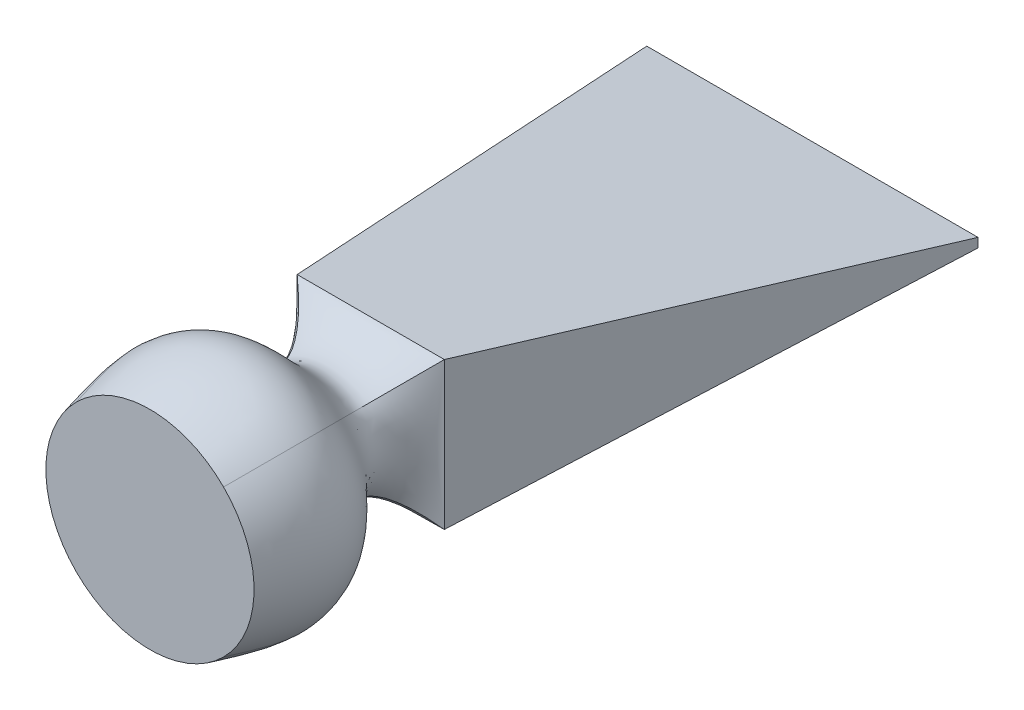
ISO-10303-21;
HEADER;
FILE_DESCRIPTION(('STEP AP214'),'2;1');
FILE_NAME('part.step','',(''),(''),'','','');
FILE_SCHEMA(('AUTOMOTIVE_DESIGN { 1 0 10303 214 1 1 1 1 }'));
ENDSEC;
DATA;
#1=APPLICATION_CONTEXT('core data for automotive mechanical design processes');
#2=APPLICATION_PROTOCOL_DEFINITION('international standard','automotive_design',2000,#1);
#3=PRODUCT_CONTEXT('',#1,'mechanical');
#4=PRODUCT('Part','Part','',(#3));
#5=PRODUCT_RELATED_PRODUCT_CATEGORY('part','',(#4));
#6=PRODUCT_DEFINITION_FORMATION('','',#4);
#7=PRODUCT_DEFINITION_CONTEXT('part definition',#1,'design');
#8=PRODUCT_DEFINITION('design','',#6,#7);
#9=PRODUCT_DEFINITION_SHAPE('','',#8);
#10=(LENGTH_UNIT() NAMED_UNIT(*) SI_UNIT(.MILLI.,.METRE.));
#11=(NAMED_UNIT(*) PLANE_ANGLE_UNIT() SI_UNIT($,.RADIAN.));
#12=(NAMED_UNIT(*) SI_UNIT($,.STERADIAN.) SOLID_ANGLE_UNIT());
#13=UNCERTAINTY_MEASURE_WITH_UNIT(LENGTH_MEASURE(1.E-05),#10,'distance_accuracy_value','');
#14=(GEOMETRIC_REPRESENTATION_CONTEXT(3) GLOBAL_UNCERTAINTY_ASSIGNED_CONTEXT((#13)) GLOBAL_UNIT_ASSIGNED_CONTEXT((#10,
#11,#12)) REPRESENTATION_CONTEXT('',''));
#15=CARTESIAN_POINT('',(0.,0.,0.));
#16=DIRECTION('',(0.,0.,1.));
#17=DIRECTION('',(1.,0.,0.));
#18=AXIS2_PLACEMENT_3D('',#15,#16,#17);
#19=CARTESIAN_POINT('',(0.,0.,120.));
#20=DIRECTION('',(0.,0.,1.));
#21=DIRECTION('',(1.,0.,0.));
#22=AXIS2_PLACEMENT_3D('',#19,#20,#21);
#23=PLANE('',#22);
#24=CARTESIAN_POINT('',(0.,0.,120.));
#25=DIRECTION('',(0.,0.,1.));
#26=DIRECTION('',(1.,0.,0.));
#27=AXIS2_PLACEMENT_3D('',#24,#25,#26);
#28=CIRCLE('',#27,56.5685424949238);
#29=CARTESIAN_POINT('',(40.,40.,120.));
#30=VERTEX_POINT('',#29);
#31=CARTESIAN_POINT('',(-40.,40.,120.));
#32=VERTEX_POINT('',#31);
#33=EDGE_CURVE('E12',#30,#32,#28,.T.);
#34=ORIENTED_EDGE('',*,*,#33,.T.);
#35=CARTESIAN_POINT('',(-40.,-40.,120.));
#36=VERTEX_POINT('',#35);
#37=EDGE_CURVE('E184',#32,#36,#28,.T.);
#38=ORIENTED_EDGE('',*,*,#37,.T.);
#39=CARTESIAN_POINT('',(40.,-40.,120.));
#40=VERTEX_POINT('',#39);
#41=EDGE_CURVE('E404',#36,#40,#28,.T.);
#42=ORIENTED_EDGE('',*,*,#41,.T.);
#43=EDGE_CURVE('E333',#40,#30,#28,.T.);
#44=ORIENTED_EDGE('',*,*,#43,.T.);
#45=EDGE_LOOP('',(#34,#38,#42,#44));
#46=FACE_BOUND('',#45,.T.);
#47=ADVANCED_FACE('F175',(#46),#23,.T.);
#48=CARTESIAN_POINT('',(-40.,40.,0.));
#49=CARTESIAN_POINT('',(-27.4754689570643,27.4754689570643,10.));
#50=CARTESIAN_POINT('',(-11.8947204291446,11.8947204291446,32.6873486435367));
#51=CARTESIAN_POINT('',(-51.8658504210996,51.8658504210997,61.8637702170009));
#52=CARTESIAN_POINT('',(-43.840184649959,43.840184649959,98.3967829380328));
#53=CARTESIAN_POINT('',(-40.,40.,120.));
#54=CARTESIAN_POINT('',(-40.,36.6666666666667,0.));
#55=CARTESIAN_POINT('',(-27.993020210486,25.2606382784789,10.3038903595026));
#56=CARTESIAN_POINT('',(-13.4608908876898,11.2033074205769,32.5304406272122));
#57=CARTESIAN_POINT('',(-54.9534209988408,48.3828038629849,61.9359519475802));
#58=CARTESIAN_POINT('',(-46.7230743139164,40.9315732365088,98.3969362491896));
#59=CARTESIAN_POINT('',(-42.65208984,37.34791016,120.));
#60=CARTESIAN_POINT('',(-40.,31.6666666666667,0.));
#61=CARTESIAN_POINT('',(-28.7693470906186,21.9383922606009,10.7597258987565));
#62=CARTESIAN_POINT('',(-15.4488633409755,9.96771951254661,32.2950786027253));
#63=CARTESIAN_POINT('',(-59.1128838345626,42.7350558968258,62.0442245434492));
#64=CARTESIAN_POINT('',(-50.6103809143646,36.2163083798921,98.3971662159247));
#65=CARTESIAN_POINT('',(-46.1931967045121,33.0174276635586,120.));
#66=CARTESIAN_POINT('',(-40.,25.,0.));
#67=CARTESIAN_POINT('',(-29.5883944416905,17.3981420751468,11.0996644725977));
#68=CARTESIAN_POINT('',(-17.5007065344625,8.08678073493347,32.1195583855776));
#69=CARTESIAN_POINT('',(-63.6051423677497,34.5095940951979,62.1249657224863));
#70=CARTESIAN_POINT('',(-54.7628097412085,29.2733814265444,98.3973471915394));
#71=CARTESIAN_POINT('',(-49.985072925353,26.6767896937507,120.));
#72=CARTESIAN_POINT('',(-40.,20.,0.));
#73=CARTESIAN_POINT('',(-30.1030006538141,13.9595304676869,11.2920050303675));
#74=CARTESIAN_POINT('',(-18.743012168115,6.57356776329644,32.0202256304617));
#75=CARTESIAN_POINT('',(-66.4153138190794,28.0475777859827,62.1707539022538));
#76=CARTESIAN_POINT('',(-57.3534143768364,23.8056143549874,98.3971123768349));
#77=CARTESIAN_POINT('',(-52.3450788527399,21.6839732900765,120.));
#78=CARTESIAN_POINT('',(-40.,15.,0.));
#79=CARTESIAN_POINT('',(-30.5044302449204,10.4916442838765,11.42231276476));
#80=CARTESIAN_POINT('',(-19.6994969603929,4.98727899470467,31.9529245168856));
#81=CARTESIAN_POINT('',(-68.6451069319628,21.3140907934409,62.2017972941066));
#82=CARTESIAN_POINT('',(-59.4014572635483,18.0965284475509,98.3968799973826));
#83=CARTESIAN_POINT('',(-54.2087291524593,16.4770290866052,120.));
#84=CARTESIAN_POINT('',(-40.,8.33333333333334,0.));
#85=CARTESIAN_POINT('',(-30.8869309853487,5.83773309784142,11.5354542151604));
#86=CARTESIAN_POINT('',(-20.6018883159679,2.7971533710389,31.8944567984615));
#87=CARTESIAN_POINT('',(-70.809264152299,12.0759780483755,62.2289074711133));
#88=CARTESIAN_POINT('',(-61.3834946525645,10.2535673476198,98.3961714981171));
#89=CARTESIAN_POINT('',(-56.0097391628533,9.32798009427144,120.));
#90=CARTESIAN_POINT('',(-40.,0.,0.));
#91=CARTESIAN_POINT('',(-31.0752139219308,2.83797457413495E-05,11.5835975351647));
#92=CARTESIAN_POINT('',(-21.0443681342468,5.05016749965629E-05,31.8695869742722));
#93=CARTESIAN_POINT('',(-71.9397557628195,-0.000305540713785387,62.2403999445307));
#94=CARTESIAN_POINT('',(-62.4125994088339,-0.000242184400418062,98.3960103669022));
#95=CARTESIAN_POINT('',(-56.9418812719675,-0.000201149808951723,120.));
#96=CARTESIAN_POINT('',(-40.,-8.33333333333334,0.));
#97=CARTESIAN_POINT('',(-30.8869245158759,-5.83778855491611,11.5354496614508));
#98=CARTESIAN_POINT('',(-20.6018795325424,-2.79725182310166,31.8944593750312));
#99=CARTESIAN_POINT('',(-70.8093207238934,-12.0753821087827,62.228905309419));
#100=CARTESIAN_POINT('',(-61.3835409908221,-10.2530950665331,98.3961749967346));
#101=CARTESIAN_POINT('',(-56.0097767963935,-9.32758776402208,120.));
#102=CARTESIAN_POINT('',(-40.,-15.,0.));
#103=CARTESIAN_POINT('',(-30.504429824246,-10.4916347893452,11.4223150443218));
#104=CARTESIAN_POINT('',(-19.6994949828031,-4.98726204674507,31.952923218097));
#105=CARTESIAN_POINT('',(-68.6451173514898,-21.314193264505,62.2017984192411));
#106=CARTESIAN_POINT('',(-59.4014647462301,-18.0966095228183,98.3968781066072));
#107=CARTESIAN_POINT('',(-54.2087358199864,-16.4770965208971,120.));
#108=CARTESIAN_POINT('',(-40.,-20.,0.));
#109=CARTESIAN_POINT('',(-30.1030013515985,-13.9595336947336,11.2920036120364));
#110=CARTESIAN_POINT('',(-18.7430141145744,-6.57357347004998,32.0202264380854));
#111=CARTESIAN_POINT('',(-66.4153029288075,-28.0475432145271,62.1707532044806));
#112=CARTESIAN_POINT('',(-57.3534062614597,-23.8055870022436,98.3971135458761));
#113=CARTESIAN_POINT('',(-52.3450718048487,-21.6839505363466,120.));
#114=CARTESIAN_POINT('',(-40.,-25.,0.));
#115=CARTESIAN_POINT('',(-29.5883933403399,-17.3981419229131,11.0996650809708));
#116=CARTESIAN_POINT('',(-17.5007042087,-8.08678062912382,32.1195580393804));
#117=CARTESIAN_POINT('',(-63.6051559788419,-34.5095949429102,62.1249660207244));
#118=CARTESIAN_POINT('',(-54.7628201038575,-29.2733823578781,98.397346693538));
#119=CARTESIAN_POINT('',(-49.9850817976392,-26.6767903025092,120.));
#120=CARTESIAN_POINT('',(-40.,-31.6666666666667,0.));
#121=CARTESIAN_POINT('',(-28.7693553687273,-21.9383808891036,10.7597257540699));
#122=CARTESIAN_POINT('',(-15.4488783388054,-9.96769920750808,32.2950786912641));
#123=CARTESIAN_POINT('',(-59.1127934316585,-42.7351786571866,62.0442244427844));
#124=CARTESIAN_POINT('',(-50.6103105651558,-36.2164040598246,98.3971664307481));
#125=CARTESIAN_POINT('',(-46.1931374130363,-33.0175082172602,120.));
#126=CARTESIAN_POINT('',(-40.,-36.6666666666667,0.));
#127=CARTESIAN_POINT('',(-27.9930235217294,-25.26063372988,10.303890301628));
#128=CARTESIAN_POINT('',(-13.4608888931774,-11.2033101587676,32.5304406626277));
#129=CARTESIAN_POINT('',(-54.9534231504353,-48.3828009152232,61.9359519073142));
#130=CARTESIAN_POINT('',(-46.7230698908232,-40.9315792870012,98.396936335119));
#131=CARTESIAN_POINT('',(-42.65208984,-37.34791016,120.));
#132=CARTESIAN_POINT('',(-40.,-40.,0.));
#133=CARTESIAN_POINT('',(-27.4754689570643,-27.4754689570643,10.));
#134=CARTESIAN_POINT('',(-11.8947204291446,-11.8947204291446,32.6873486435367));
#135=CARTESIAN_POINT('',(-51.8658504210997,-51.8658504210996,61.8637702170009));
#136=CARTESIAN_POINT('',(-43.840184649959,-43.840184649959,98.3967829380328));
#137=CARTESIAN_POINT('',(-40.,-40.,120.));
#138=B_SPLINE_SURFACE_WITH_KNOTS('',3,3,((#48,#49,#50,#51,#52,#53),(#54,#55,#56,#57,#58,#59),
(#60,#61,#62,#63,#64,#65),(#66,#67,#68,#69,#70,#71),(#72,#73,#74,#75,#76,#77),(#78,#79,#80,#81,
#82,#83),(#84,#85,#86,#87,#88,#89),(#90,#91,#92,#93,#94,#95),(#96,#97,#98,#99,#100,#101),(#102,
#103,#104,#105,#106,#107),(#108,#109,#110,#111,#112,#113),(#114,#115,#116,#117,#118,#119),(#120,
#121,#122,#123,#124,#125),(#126,#127,#128,#129,#130,#131),(#132,#133,#134,#135,#136,#137)),
.UNSPECIFIED.,.F.,.F.,.F.,(4,1,1,1,1,1,1,1,1,1,1,1,4),(4,1,1,4),(0.,0.125,0.1875,0.25,0.3125,
0.375,0.5,0.625,0.6875,0.75,0.8125,0.875,1.),(0.,0.263741236616077,0.558569306331452,1.),.UNSPECIFIED.);
#139=DIRECTION('',(0.,-1.,0.));
#140=VECTOR('',#139,1.);
#141=CARTESIAN_POINT('',(-40.,-40.,0.));
#142=LINE('',#141,#140);
#143=CARTESIAN_POINT('',(-40.,40.,0.));
#144=VERTEX_POINT('',#143);
#145=CARTESIAN_POINT('',(-40.,-40.,0.));
#146=VERTEX_POINT('',#145);
#147=EDGE_CURVE('E236',#144,#146,#142,.T.);
#148=CARTESIAN_POINT('',(-40.,-40.,0.));
#149=CARTESIAN_POINT('',(-27.4754689570643,-27.4754689570643,10.));
#150=CARTESIAN_POINT('',(-11.8947204291446,-11.8947204291446,32.6873486435367));
#151=CARTESIAN_POINT('',(-51.8658504210997,-51.8658504210996,61.8637702170009));
#152=CARTESIAN_POINT('',(-43.840184649959,-43.840184649959,98.3967829380328));
#153=CARTESIAN_POINT('',(-40.,-40.,120.));
#154=B_SPLINE_CURVE_WITH_KNOTS('',3,(#148,#149,#150,#151,#152,#153),.UNSPECIFIED.,.F.,.F.,(4,1,
1,4),(0.,0.263741236616077,0.558569306331452,1.),.UNSPECIFIED.);
#155=EDGE_CURVE('E305',#146,#36,#154,.T.);
#156=CARTESIAN_POINT('',(-40.,40.,0.));
#157=CARTESIAN_POINT('',(-27.4754689570643,27.4754689570643,10.));
#158=CARTESIAN_POINT('',(-11.8947204291446,11.8947204291446,32.6873486435367));
#159=CARTESIAN_POINT('',(-51.8658504210996,51.8658504210997,61.8637702170009));
#160=CARTESIAN_POINT('',(-43.840184649959,43.840184649959,98.3967829380328));
#161=CARTESIAN_POINT('',(-40.,40.,120.));
#162=B_SPLINE_CURVE_WITH_KNOTS('',3,(#156,#157,#158,#159,#160,#161),.UNSPECIFIED.,.F.,.F.,(4,1,
1,4),(0.,0.263741236616077,0.558569306331452,1.),.UNSPECIFIED.);
#163=EDGE_CURVE('E314',#32,#144,#162,.F.);
#164=ORIENTED_EDGE('',*,*,#147,.T.);
#165=ORIENTED_EDGE('',*,*,#155,.T.);
#166=ORIENTED_EDGE('',*,*,#37,.F.);
#167=ORIENTED_EDGE('',*,*,#163,.T.);
#168=EDGE_LOOP('',(#164,#165,#166,#167));
#169=FACE_BOUND('',#168,.T.);
#170=ADVANCED_FACE('F460',(#169),#138,.T.);
#171=CARTESIAN_POINT('',(-40.,-40.,0.));
#172=CARTESIAN_POINT('',(-27.4754689570643,-27.4754689570643,10.));
#173=CARTESIAN_POINT('',(-11.8947204291446,-11.8947204291446,32.6873486435367));
#174=CARTESIAN_POINT('',(-51.8658504210997,-51.8658504210996,61.8637702170009));
#175=CARTESIAN_POINT('',(-43.840184649959,-43.840184649959,98.3967829380328));
#176=CARTESIAN_POINT('',(-40.,-40.,120.));
#177=CARTESIAN_POINT('',(-36.6666666666667,-40.,0.));
#178=CARTESIAN_POINT('',(-25.2606382784789,-27.993020210486,10.3038903595026));
#179=CARTESIAN_POINT('',(-11.2033074205769,-13.4608908876898,32.5304406272122));
#180=CARTESIAN_POINT('',(-48.3828038629849,-54.9534209988408,61.9359519475802));
#181=CARTESIAN_POINT('',(-40.9315732365088,-46.7230743139164,98.3969362491895));
#182=CARTESIAN_POINT('',(-37.34791016,-42.65208984,120.));
#183=CARTESIAN_POINT('',(-31.6666666666667,-40.,0.));
#184=CARTESIAN_POINT('',(-21.9383922606009,-28.7693470906185,10.7597258987565));
#185=CARTESIAN_POINT('',(-9.9677195125466,-15.4488633409756,32.2950786027253));
#186=CARTESIAN_POINT('',(-42.7350558968258,-59.1128838345625,62.0442245434492));
#187=CARTESIAN_POINT('',(-36.216308379892,-50.6103809143646,98.3971662159249));
#188=CARTESIAN_POINT('',(-33.0174276635586,-46.1931967045121,120.));
#189=CARTESIAN_POINT('',(-25.,-40.,0.));
#190=CARTESIAN_POINT('',(-17.3981420751467,-29.5883944416905,11.0996644725977));
#191=CARTESIAN_POINT('',(-8.08678073493348,-17.5007065344625,32.1195583855776));
#192=CARTESIAN_POINT('',(-34.5095940951979,-63.6051423677497,62.1249657224863));
#193=CARTESIAN_POINT('',(-29.2733814265445,-54.7628097412085,98.3973471915391));
#194=CARTESIAN_POINT('',(-26.6767896937507,-49.985072925353,120.));
#195=CARTESIAN_POINT('',(-20.,-40.,0.));
#196=CARTESIAN_POINT('',(-13.9595304676869,-30.103000653814,11.2920050303675));
#197=CARTESIAN_POINT('',(-6.57356776329642,-18.743012168115,32.0202256304617));
#198=CARTESIAN_POINT('',(-28.0475777859827,-66.4153138190794,62.1707539022538));
#199=CARTESIAN_POINT('',(-23.8056143549874,-57.3534143768364,98.3971123768349));
#200=CARTESIAN_POINT('',(-21.6839732900764,-52.3450788527399,120.));
#201=CARTESIAN_POINT('',(-15.,-40.,0.));
#202=CARTESIAN_POINT('',(-10.4916442838765,-30.5044302449204,11.42231276476));
#203=CARTESIAN_POINT('',(-4.98727899470466,-19.6994969603929,31.9529245168856));
#204=CARTESIAN_POINT('',(-21.3140907934409,-68.6451069319628,62.2017972941066));
#205=CARTESIAN_POINT('',(-18.0965284475509,-59.4014572635483,98.3968799973826));
#206=CARTESIAN_POINT('',(-16.4770290866053,-54.2087291524593,120.));
#207=CARTESIAN_POINT('',(-8.33333333333334,-40.,0.));
#208=CARTESIAN_POINT('',(-5.83773309784143,-30.8869309853488,11.5354542151604));
#209=CARTESIAN_POINT('',(-2.7971533710389,-20.6018883159679,31.8944567984615));
#210=CARTESIAN_POINT('',(-12.0759780483755,-70.8092641522991,62.2289074711133));
#211=CARTESIAN_POINT('',(-10.2535673476198,-61.3834946525645,98.3961714981169));
#212=CARTESIAN_POINT('',(-9.32798009427143,-56.0097391628533,120.));
#213=CARTESIAN_POINT('',(0.,-40.,0.));
#214=CARTESIAN_POINT('',(-2.83797457423056E-05,-31.0752139219308,11.5835975351647));
#215=CARTESIAN_POINT('',(-5.05016750047153E-05,-21.0443681342468,31.8695869742721));
#216=CARTESIAN_POINT('',(0.000305540713795257,-71.9397557628194,62.2403999445307));
#217=CARTESIAN_POINT('',(0.000242184400417761,-62.4125994088339,98.3960103669023));
#218=CARTESIAN_POINT('',(0.000201149808955192,-56.9418812719674,120.));
#219=CARTESIAN_POINT('',(8.33333333333333,-40.,0.));
#220=CARTESIAN_POINT('',(5.8377885549161,-30.8869245158759,11.5354496614508));
#221=CARTESIAN_POINT('',(2.79725182310166,-20.6018795325424,31.8944593750312));
#222=CARTESIAN_POINT('',(12.0753821087827,-70.8093207238933,62.2289053094188));
#223=CARTESIAN_POINT('',(10.2530950665331,-61.3835409908221,98.3961749967346));
#224=CARTESIAN_POINT('',(9.32758776402208,-56.0097767963935,120.));
#225=CARTESIAN_POINT('',(15.,-40.,0.));
#226=CARTESIAN_POINT('',(10.4916347893452,-30.504429824246,11.4223150443218));
#227=CARTESIAN_POINT('',(4.98726204674506,-19.6994949828031,31.952923218097));
#228=CARTESIAN_POINT('',(21.314193264505,-68.6451173514898,62.2017984192413));
#229=CARTESIAN_POINT('',(18.0966095228182,-59.40146474623,98.3968781066071));
#230=CARTESIAN_POINT('',(16.4770965208971,-54.2087358199865,120.));
#231=CARTESIAN_POINT('',(20.,-40.,0.));
#232=CARTESIAN_POINT('',(13.9595336947336,-30.1030013515985,11.2920036120364));
#233=CARTESIAN_POINT('',(6.57357347004998,-18.7430141145744,32.0202264380854));
#234=CARTESIAN_POINT('',(28.0475432145271,-66.4153029288075,62.1707532044805));
#235=CARTESIAN_POINT('',(23.8055870022436,-57.3534062614597,98.3971135458763));
#236=CARTESIAN_POINT('',(21.6839505363467,-52.3450718048487,120.));
#237=CARTESIAN_POINT('',(25.,-40.,0.));
#238=CARTESIAN_POINT('',(17.3981419229131,-29.5883933403399,11.0996650809708));
#239=CARTESIAN_POINT('',(8.08678062912382,-17.5007042087,32.1195580393803));
#240=CARTESIAN_POINT('',(34.5095949429102,-63.6051559788419,62.1249660207244));
#241=CARTESIAN_POINT('',(29.2733823578781,-54.7628201038574,98.3973466935381));
#242=CARTESIAN_POINT('',(26.6767903025092,-49.9850817976392,120.));
#243=CARTESIAN_POINT('',(31.6666666666667,-40.,0.));
#244=CARTESIAN_POINT('',(21.9383808891035,-28.7693553687272,10.7597257540699));
#245=CARTESIAN_POINT('',(9.96769920750808,-15.4488783388054,32.2950786912641));
#246=CARTESIAN_POINT('',(42.7351786571867,-59.1127934316585,62.0442244427843));
#247=CARTESIAN_POINT('',(36.2164040598246,-50.6103105651559,98.397166430748));
#248=CARTESIAN_POINT('',(33.0175082172602,-46.1931374130363,120.));
#249=CARTESIAN_POINT('',(36.6666666666667,-40.,0.));
#250=CARTESIAN_POINT('',(25.26063372988,-27.9930235217295,10.303890301628));
#251=CARTESIAN_POINT('',(11.2033101587676,-13.4608888931774,32.5304406626277));
#252=CARTESIAN_POINT('',(48.3828009152232,-54.9534231504353,61.9359519073142));
#253=CARTESIAN_POINT('',(40.9315792870012,-46.7230698908232,98.396936335119));
#254=CARTESIAN_POINT('',(37.34791016,-42.65208984,120.));
#255=CARTESIAN_POINT('',(40.,-40.,0.));
#256=CARTESIAN_POINT('',(27.4754689570643,-27.4754689570643,10.));
#257=CARTESIAN_POINT('',(11.8947204291446,-11.8947204291446,32.6873486435367));
#258=CARTESIAN_POINT('',(51.8658504210996,-51.8658504210997,61.8637702170009));
#259=CARTESIAN_POINT('',(43.840184649959,-43.840184649959,98.3967829380328));
#260=CARTESIAN_POINT('',(40.,-40.,120.));
#261=B_SPLINE_SURFACE_WITH_KNOTS('',3,3,((#171,#172,#173,#174,#175,#176),(#177,#178,#179,#180,
#181,#182),(#183,#184,#185,#186,#187,#188),(#189,#190,#191,#192,#193,#194),(#195,#196,#197,#198,
#199,#200),(#201,#202,#203,#204,#205,#206),(#207,#208,#209,#210,#211,#212),(#213,#214,#215,#216,
#217,#218),(#219,#220,#221,#222,#223,#224),(#225,#226,#227,#228,#229,#230),(#231,#232,#233,#234,
#235,#236),(#237,#238,#239,#240,#241,#242),(#243,#244,#245,#246,#247,#248),(#249,#250,#251,#252,
#253,#254),(#255,#256,#257,#258,#259,#260)),.UNSPECIFIED.,.F.,.F.,.F.,(4,1,1,1,1,1,1,1,1,1,1,1,
4),(4,1,1,4),(0.,0.125,0.1875,0.25,0.3125,0.375,0.5,0.625,0.6875,0.75,0.8125,0.875,1.),(0.,
0.263741236616077,0.558569306331452,1.),.UNSPECIFIED.);
#262=DIRECTION('',(1.,0.,0.));
#263=VECTOR('',#262,1.);
#264=CARTESIAN_POINT('',(-40.,-40.,0.));
#265=LINE('',#264,#263);
#266=CARTESIAN_POINT('',(40.,-40.,0.));
#267=VERTEX_POINT('',#266);
#268=EDGE_CURVE('E343',#146,#267,#265,.T.);
#269=CARTESIAN_POINT('',(40.,-40.,0.));
#270=CARTESIAN_POINT('',(27.4754689570643,-27.4754689570643,10.));
#271=CARTESIAN_POINT('',(11.8947204291446,-11.8947204291446,32.6873486435367));
#272=CARTESIAN_POINT('',(51.8658504210996,-51.8658504210997,61.8637702170009));
#273=CARTESIAN_POINT('',(43.840184649959,-43.840184649959,98.3967829380328));
#274=CARTESIAN_POINT('',(40.,-40.,120.));
#275=B_SPLINE_CURVE_WITH_KNOTS('',3,(#269,#270,#271,#272,#273,#274),.UNSPECIFIED.,.F.,.F.,(4,1,
1,4),(0.,0.263741236616077,0.558569306331452,1.),.UNSPECIFIED.);
#276=EDGE_CURVE('E313',#267,#40,#275,.T.);
#277=ORIENTED_EDGE('',*,*,#268,.T.);
#278=ORIENTED_EDGE('',*,*,#276,.T.);
#279=ORIENTED_EDGE('',*,*,#41,.F.);
#280=ORIENTED_EDGE('',*,*,#155,.F.);
#281=EDGE_LOOP('',(#277,#278,#279,#280));
#282=FACE_BOUND('',#281,.T.);
#283=ADVANCED_FACE('F380',(#282),#261,.T.);
#284=CARTESIAN_POINT('',(40.,40.,0.));
#285=CARTESIAN_POINT('',(27.4754689570643,27.4754689570643,10.));
#286=CARTESIAN_POINT('',(11.8947204291446,11.8947204291446,32.6873486435367));
#287=CARTESIAN_POINT('',(51.8658504210997,51.8658504210996,61.8637702170009));
#288=CARTESIAN_POINT('',(43.840184649959,43.840184649959,98.3967829380328));
#289=CARTESIAN_POINT('',(40.,40.,120.));
#290=CARTESIAN_POINT('',(36.6666666666667,40.,0.));
#291=CARTESIAN_POINT('',(25.2606382784789,27.9930202104859,10.3038903595026));
#292=CARTESIAN_POINT('',(11.2033074205769,13.4608908876899,32.5304406272122));
#293=CARTESIAN_POINT('',(48.3828038629849,54.9534209988408,61.9359519475802));
#294=CARTESIAN_POINT('',(40.9315732365088,46.7230743139164,98.3969362491896));
#295=CARTESIAN_POINT('',(37.34791016,42.65208984,120.));
#296=CARTESIAN_POINT('',(31.6666666666667,40.,0.));
#297=CARTESIAN_POINT('',(21.938392260601,28.7693470906185,10.7597258987565));
#298=CARTESIAN_POINT('',(9.9677195125466,15.4488633409756,32.2950786027253));
#299=CARTESIAN_POINT('',(42.7350558968258,59.1128838345625,62.0442245434492));
#300=CARTESIAN_POINT('',(36.2163083798921,50.6103809143646,98.3971662159247));
#301=CARTESIAN_POINT('',(33.0174276635586,46.1931967045121,120.));
#302=CARTESIAN_POINT('',(25.,40.,0.));
#303=CARTESIAN_POINT('',(17.3981420751467,29.5883944416906,11.0996644725977));
#304=CARTESIAN_POINT('',(8.08678073493349,17.5007065344625,32.1195583855776));
#305=CARTESIAN_POINT('',(34.5095940951979,63.6051423677497,62.1249657224863));
#306=CARTESIAN_POINT('',(29.2733814265444,54.7628097412085,98.3973471915394));
#307=CARTESIAN_POINT('',(26.6767896937507,49.985072925353,120.));
#308=CARTESIAN_POINT('',(20.,40.,0.));
#309=CARTESIAN_POINT('',(13.9595304676869,30.103000653814,11.2920050303675));
#310=CARTESIAN_POINT('',(6.57356776329643,18.743012168115,32.0202256304617));
#311=CARTESIAN_POINT('',(28.0475777859827,66.4153138190794,62.1707539022538));
#312=CARTESIAN_POINT('',(23.8056143549874,57.3534143768364,98.3971123768349));
#313=CARTESIAN_POINT('',(21.6839732900765,52.3450788527399,120.));
#314=CARTESIAN_POINT('',(15.,40.,0.));
#315=CARTESIAN_POINT('',(10.4916442838765,30.5044302449204,11.42231276476));
#316=CARTESIAN_POINT('',(4.98727899470467,19.6994969603929,31.9529245168856));
#317=CARTESIAN_POINT('',(21.3140907934409,68.6451069319628,62.2017972941066));
#318=CARTESIAN_POINT('',(18.0965284475509,59.4014572635483,98.3968799973826));
#319=CARTESIAN_POINT('',(16.4770290866052,54.2087291524593,120.));
#320=CARTESIAN_POINT('',(8.33333333333333,40.,0.));
#321=CARTESIAN_POINT('',(5.83773309784142,30.8869309853488,11.5354542151604));
#322=CARTESIAN_POINT('',(2.7971533710389,20.6018883159679,31.8944567984615));
#323=CARTESIAN_POINT('',(12.0759780483755,70.809264152299,62.2289074711133));
#324=CARTESIAN_POINT('',(10.2535673476198,61.3834946525645,98.3961714981171));
#325=CARTESIAN_POINT('',(9.32798009427144,56.0097391628533,120.));
#326=CARTESIAN_POINT('',(0.,40.,0.));
#327=CARTESIAN_POINT('',(2.83797457419061E-05,31.0752139219308,11.5835975351647));
#328=CARTESIAN_POINT('',(5.05016749962755E-05,21.0443681342468,31.8695869742722));
#329=CARTESIAN_POINT('',(-0.000305540713785254,71.9397557628194,62.2403999445307));
#330=CARTESIAN_POINT('',(-0.000242184400418062,62.4125994088339,98.3960103669022));
#331=CARTESIAN_POINT('',(-0.000201149808951723,56.9418812719675,120.));
#332=CARTESIAN_POINT('',(-8.33333333333334,40.,0.));
#333=CARTESIAN_POINT('',(-5.83778855491613,30.8869245158759,11.5354496614508));
#334=CARTESIAN_POINT('',(-2.79725182310165,20.6018795325424,31.8944593750312));
#335=CARTESIAN_POINT('',(-12.0753821087827,70.8093207238934,62.228905309419));
#336=CARTESIAN_POINT('',(-10.2530950665331,61.3835409908221,98.3961749967346));
#337=CARTESIAN_POINT('',(-9.32758776402208,56.0097767963935,120.));
#338=CARTESIAN_POINT('',(-15.,40.,0.));
#339=CARTESIAN_POINT('',(-10.4916347893452,30.504429824246,11.4223150443218));
#340=CARTESIAN_POINT('',(-4.98726204674507,19.6994949828031,31.952923218097));
#341=CARTESIAN_POINT('',(-21.314193264505,68.6451173514897,62.2017984192412));
#342=CARTESIAN_POINT('',(-18.0966095228183,59.4014647462301,98.3968781066072));
#343=CARTESIAN_POINT('',(-16.4770965208971,54.2087358199864,120.));
#344=CARTESIAN_POINT('',(-20.,40.,0.));
#345=CARTESIAN_POINT('',(-13.9595336947336,30.1030013515985,11.2920036120364));
#346=CARTESIAN_POINT('',(-6.57357347004998,18.7430141145744,32.0202264380854));
#347=CARTESIAN_POINT('',(-28.0475432145271,66.4153029288075,62.1707532044806));
#348=CARTESIAN_POINT('',(-23.8055870022436,57.3534062614597,98.3971135458761));
#349=CARTESIAN_POINT('',(-21.6839505363466,52.3450718048487,120.));
#350=CARTESIAN_POINT('',(-25.,40.,0.));
#351=CARTESIAN_POINT('',(-17.3981419229131,29.5883933403399,11.0996650809709));
#352=CARTESIAN_POINT('',(-8.08678062912383,17.5007042087,32.1195580393803));
#353=CARTESIAN_POINT('',(-34.5095949429102,63.6051559788419,62.1249660207244));
#354=CARTESIAN_POINT('',(-29.2733823578781,54.7628201038575,98.397346693538));
#355=CARTESIAN_POINT('',(-26.6767903025092,49.9850817976392,120.));
#356=CARTESIAN_POINT('',(-31.6666666666667,40.,0.));
#357=CARTESIAN_POINT('',(-21.9383808891036,28.7693553687272,10.7597257540699));
#358=CARTESIAN_POINT('',(-9.96769920750809,15.4488783388054,32.2950786912641));
#359=CARTESIAN_POINT('',(-42.7351786571866,59.1127934316585,62.0442244427844));
#360=CARTESIAN_POINT('',(-36.2164040598246,50.6103105651558,98.3971664307481));
#361=CARTESIAN_POINT('',(-33.0175082172602,46.1931374130363,120.));
#362=CARTESIAN_POINT('',(-36.6666666666667,40.,0.));
#363=CARTESIAN_POINT('',(-25.26063372988,27.9930235217295,10.3038903016279));
#364=CARTESIAN_POINT('',(-11.2033101587676,13.4608888931774,32.5304406626277));
#365=CARTESIAN_POINT('',(-48.3828009152232,54.9534231504353,61.9359519073142));
#366=CARTESIAN_POINT('',(-40.9315792870012,46.7230698908232,98.396936335119));
#367=CARTESIAN_POINT('',(-37.34791016,42.65208984,120.));
#368=CARTESIAN_POINT('',(-40.,40.,0.));
#369=CARTESIAN_POINT('',(-27.4754689570643,27.4754689570643,10.));
#370=CARTESIAN_POINT('',(-11.8947204291446,11.8947204291446,32.6873486435367));
#371=CARTESIAN_POINT('',(-51.8658504210996,51.8658504210997,61.8637702170009));
#372=CARTESIAN_POINT('',(-43.840184649959,43.840184649959,98.3967829380328));
#373=CARTESIAN_POINT('',(-40.,40.,120.));
#374=B_SPLINE_SURFACE_WITH_KNOTS('',3,3,((#284,#285,#286,#287,#288,#289),(#290,#291,#292,#293,
#294,#295),(#296,#297,#298,#299,#300,#301),(#302,#303,#304,#305,#306,#307),(#308,#309,#310,#311,
#312,#313),(#314,#315,#316,#317,#318,#319),(#320,#321,#322,#323,#324,#325),(#326,#327,#328,#329,
#330,#331),(#332,#333,#334,#335,#336,#337),(#338,#339,#340,#341,#342,#343),(#344,#345,#346,#347,
#348,#349),(#350,#351,#352,#353,#354,#355),(#356,#357,#358,#359,#360,#361),(#362,#363,#364,#365,
#366,#367),(#368,#369,#370,#371,#372,#373)),.UNSPECIFIED.,.F.,.F.,.F.,(4,1,1,1,1,1,1,1,1,1,1,1,
4),(4,1,1,4),(0.,0.125,0.1875,0.25,0.3125,0.375,0.5,0.625,0.6875,0.75,0.8125,0.875,1.),(0.,
0.263741236616077,0.558569306331452,1.),.UNSPECIFIED.);
#375=DIRECTION('',(-1.,0.,0.));
#376=VECTOR('',#375,1.);
#377=CARTESIAN_POINT('',(-40.,40.,0.));
#378=LINE('',#377,#376);
#379=CARTESIAN_POINT('',(40.,40.,0.));
#380=VERTEX_POINT('',#379);
#381=EDGE_CURVE('E444',#380,#144,#378,.T.);
#382=CARTESIAN_POINT('',(40.,40.,0.));
#383=CARTESIAN_POINT('',(27.4754689570643,27.4754689570643,10.));
#384=CARTESIAN_POINT('',(11.8947204291446,11.8947204291446,32.6873486435367));
#385=CARTESIAN_POINT('',(51.8658504210997,51.8658504210996,61.8637702170009));
#386=CARTESIAN_POINT('',(43.840184649959,43.840184649959,98.3967829380328));
#387=CARTESIAN_POINT('',(40.,40.,120.));
#388=B_SPLINE_CURVE_WITH_KNOTS('',3,(#382,#383,#384,#385,#386,#387),.UNSPECIFIED.,.F.,.F.,(4,1,
1,4),(0.,0.263741236616077,0.558569306331452,1.),.UNSPECIFIED.);
#389=EDGE_CURVE('E324',#380,#30,#388,.T.);
#390=ORIENTED_EDGE('',*,*,#381,.T.);
#391=ORIENTED_EDGE('',*,*,#163,.F.);
#392=ORIENTED_EDGE('',*,*,#33,.F.);
#393=ORIENTED_EDGE('',*,*,#389,.F.);
#394=EDGE_LOOP('',(#390,#391,#392,#393));
#395=FACE_BOUND('',#394,.T.);
#396=ADVANCED_FACE('F369',(#395),#374,.T.);
#397=CARTESIAN_POINT('',(40.,-40.,0.));
#398=CARTESIAN_POINT('',(27.4754689570643,-27.4754689570643,10.));
#399=CARTESIAN_POINT('',(11.8947204291446,-11.8947204291446,32.6873486435367));
#400=CARTESIAN_POINT('',(51.8658504210996,-51.8658504210997,61.8637702170009));
#401=CARTESIAN_POINT('',(43.840184649959,-43.840184649959,98.3967829380328));
#402=CARTESIAN_POINT('',(40.,-40.,120.));
#403=CARTESIAN_POINT('',(40.,-36.6666666666667,0.));
#404=CARTESIAN_POINT('',(27.993020210486,-25.2606382784789,10.3038903595026));
#405=CARTESIAN_POINT('',(13.4608908876898,-11.2033074205769,32.5304406272122));
#406=CARTESIAN_POINT('',(54.9534209988408,-48.3828038629849,61.9359519475802));
#407=CARTESIAN_POINT('',(46.7230743139164,-40.9315732365088,98.3969362491895));
#408=CARTESIAN_POINT('',(42.65208984,-37.34791016,120.));
#409=CARTESIAN_POINT('',(40.,-31.6666666666667,0.));
#410=CARTESIAN_POINT('',(28.7693470906185,-21.9383922606009,10.7597258987565));
#411=CARTESIAN_POINT('',(15.4488633409756,-9.96771951254662,32.2950786027253));
#412=CARTESIAN_POINT('',(59.1128838345626,-42.7350558968258,62.0442245434492));
#413=CARTESIAN_POINT('',(50.6103809143646,-36.216308379892,98.3971662159249));
#414=CARTESIAN_POINT('',(46.1931967045121,-33.0174276635586,120.));
#415=CARTESIAN_POINT('',(40.,-25.,0.));
#416=CARTESIAN_POINT('',(29.5883944416905,-17.3981420751468,11.0996644725977));
#417=CARTESIAN_POINT('',(17.5007065344625,-8.08678073493347,32.1195583855776));
#418=CARTESIAN_POINT('',(63.6051423677497,-34.5095940951979,62.1249657224863));
#419=CARTESIAN_POINT('',(54.7628097412085,-29.2733814265445,98.3973471915391));
#420=CARTESIAN_POINT('',(49.985072925353,-26.6767896937507,120.));
#421=CARTESIAN_POINT('',(40.,-20.,0.));
#422=CARTESIAN_POINT('',(30.103000653814,-13.9595304676869,11.2920050303675));
#423=CARTESIAN_POINT('',(18.743012168115,-6.57356776329646,32.0202256304617));
#424=CARTESIAN_POINT('',(66.4153138190794,-28.0475777859827,62.1707539022538));
#425=CARTESIAN_POINT('',(57.3534143768364,-23.8056143549873,98.3971123768349));
#426=CARTESIAN_POINT('',(52.3450788527399,-21.6839732900764,120.));
#427=CARTESIAN_POINT('',(40.,-15.,0.));
#428=CARTESIAN_POINT('',(30.5044302449204,-10.4916442838765,11.42231276476));
#429=CARTESIAN_POINT('',(19.6994969603929,-4.98727899470468,31.9529245168856));
#430=CARTESIAN_POINT('',(68.6451069319628,-21.3140907934409,62.2017972941066));
#431=CARTESIAN_POINT('',(59.4014572635483,-18.0965284475509,98.3968799973826));
#432=CARTESIAN_POINT('',(54.2087291524593,-16.4770290866053,120.));
#433=CARTESIAN_POINT('',(40.,-8.33333333333334,0.));
#434=CARTESIAN_POINT('',(30.8869309853487,-5.83773309784143,11.5354542151604));
#435=CARTESIAN_POINT('',(20.6018883159679,-2.79715337103892,31.8944567984615));
#436=CARTESIAN_POINT('',(70.8092641522991,-12.0759780483755,62.2289074711133));
#437=CARTESIAN_POINT('',(61.3834946525645,-10.2535673476198,98.3961714981169));
#438=CARTESIAN_POINT('',(56.0097391628533,-9.32798009427143,120.));
#439=CARTESIAN_POINT('',(40.,0.,0.));
#440=CARTESIAN_POINT('',(31.0752139219309,-2.83797457451194E-05,11.5835975351647));
#441=CARTESIAN_POINT('',(21.0443681342467,-5.05016750043872E-05,31.8695869742721));
#442=CARTESIAN_POINT('',(71.9397557628194,0.000305540713794756,62.2403999445307));
#443=CARTESIAN_POINT('',(62.4125994088339,0.000242184400419018,98.3960103669023));
#444=CARTESIAN_POINT('',(56.9418812719674,0.000201149808955192,120.));
#445=CARTESIAN_POINT('',(40.,8.33333333333334,0.));
#446=CARTESIAN_POINT('',(30.886924515876,5.83778855491611,11.5354496614508));
#447=CARTESIAN_POINT('',(20.6018795325424,2.79725182310165,31.8944593750312));
#448=CARTESIAN_POINT('',(70.8093207238933,12.0753821087827,62.2289053094188));
#449=CARTESIAN_POINT('',(61.3835409908221,10.2530950665331,98.3961749967346));
#450=CARTESIAN_POINT('',(56.0097767963935,9.32758776402208,120.));
#451=CARTESIAN_POINT('',(40.,15.,0.));
#452=CARTESIAN_POINT('',(30.504429824246,10.4916347893452,11.4223150443218));
#453=CARTESIAN_POINT('',(19.6994949828031,4.98726204674506,31.952923218097));
#454=CARTESIAN_POINT('',(68.6451173514898,21.314193264505,62.2017984192413));
#455=CARTESIAN_POINT('',(59.40146474623,18.0966095228182,98.3968781066071));
#456=CARTESIAN_POINT('',(54.2087358199865,16.4770965208971,120.));
#457=CARTESIAN_POINT('',(40.,20.,0.));
#458=CARTESIAN_POINT('',(30.1030013515985,13.9595336947336,11.2920036120364));
#459=CARTESIAN_POINT('',(18.7430141145744,6.57357347004996,32.0202264380854));
#460=CARTESIAN_POINT('',(66.4153029288075,28.0475432145271,62.1707532044805));
#461=CARTESIAN_POINT('',(57.3534062614597,23.8055870022436,98.3971135458763));
#462=CARTESIAN_POINT('',(52.3450718048487,21.6839505363467,120.));
#463=CARTESIAN_POINT('',(40.,25.,0.));
#464=CARTESIAN_POINT('',(29.5883933403399,17.3981419229131,11.0996650809708));
#465=CARTESIAN_POINT('',(17.5007042087,8.08678062912382,32.1195580393803));
#466=CARTESIAN_POINT('',(63.6051559788419,34.5095949429102,62.1249660207244));
#467=CARTESIAN_POINT('',(54.7628201038574,29.2733823578781,98.3973466935381));
#468=CARTESIAN_POINT('',(49.9850817976392,26.6767903025092,120.));
#469=CARTESIAN_POINT('',(40.,31.6666666666667,0.));
#470=CARTESIAN_POINT('',(28.7693553687272,21.9383808891036,10.7597257540699));
#471=CARTESIAN_POINT('',(15.4488783388054,9.96769920750806,32.2950786912641));
#472=CARTESIAN_POINT('',(59.1127934316585,42.7351786571867,62.0442244427843));
#473=CARTESIAN_POINT('',(50.6103105651559,36.2164040598246,98.397166430748));
#474=CARTESIAN_POINT('',(46.1931374130363,33.0175082172602,120.));
#475=CARTESIAN_POINT('',(40.,36.6666666666667,0.));
#476=CARTESIAN_POINT('',(27.9930235217295,25.26063372988,10.303890301628));
#477=CARTESIAN_POINT('',(13.4608888931774,11.2033101587676,32.5304406626277));
#478=CARTESIAN_POINT('',(54.9534231504353,48.3828009152232,61.9359519073142));
#479=CARTESIAN_POINT('',(46.7230698908232,40.9315792870012,98.396936335119));
#480=CARTESIAN_POINT('',(42.65208984,37.34791016,120.));
#481=CARTESIAN_POINT('',(40.,40.,0.));
#482=CARTESIAN_POINT('',(27.4754689570643,27.4754689570643,10.));
#483=CARTESIAN_POINT('',(11.8947204291446,11.8947204291446,32.6873486435367));
#484=CARTESIAN_POINT('',(51.8658504210997,51.8658504210996,61.8637702170009));
#485=CARTESIAN_POINT('',(43.840184649959,43.840184649959,98.3967829380328));
#486=CARTESIAN_POINT('',(40.,40.,120.));
#487=B_SPLINE_SURFACE_WITH_KNOTS('',3,3,((#397,#398,#399,#400,#401,#402),(#403,#404,#405,#406,
#407,#408),(#409,#410,#411,#412,#413,#414),(#415,#416,#417,#418,#419,#420),(#421,#422,#423,#424,
#425,#426),(#427,#428,#429,#430,#431,#432),(#433,#434,#435,#436,#437,#438),(#439,#440,#441,#442,
#443,#444),(#445,#446,#447,#448,#449,#450),(#451,#452,#453,#454,#455,#456),(#457,#458,#459,#460,
#461,#462),(#463,#464,#465,#466,#467,#468),(#469,#470,#471,#472,#473,#474),(#475,#476,#477,#478,
#479,#480),(#481,#482,#483,#484,#485,#486)),.UNSPECIFIED.,.F.,.F.,.F.,(4,1,1,1,1,1,1,1,1,1,1,1,
4),(4,1,1,4),(0.,0.125,0.1875,0.25,0.3125,0.375,0.5,0.625,0.6875,0.75,0.8125,0.875,1.),(0.,
0.263741236616077,0.558569306331452,1.),.UNSPECIFIED.);
#488=DIRECTION('',(0.,1.,0.));
#489=VECTOR('',#488,1.);
#490=CARTESIAN_POINT('',(40.,-40.,0.));
#491=LINE('',#490,#489);
#492=EDGE_CURVE('E239',#267,#380,#491,.T.);
#493=ORIENTED_EDGE('',*,*,#492,.T.);
#494=ORIENTED_EDGE('',*,*,#389,.T.);
#495=ORIENTED_EDGE('',*,*,#43,.F.);
#496=ORIENTED_EDGE('',*,*,#276,.F.);
#497=EDGE_LOOP('',(#493,#494,#495,#496));
#498=FACE_BOUND('',#497,.T.);
#499=ADVANCED_FACE('F279',(#498),#487,.T.);
#500=CARTESIAN_POINT('',(0.,0.,-240.));
#501=DIRECTION('',(0.,0.,1.));
#502=DIRECTION('',(1.,0.,0.));
#503=AXIS2_PLACEMENT_3D('',#500,#501,#502);
#504=PLANE('',#503);
#505=DIRECTION('',(0.,1.,0.));
#506=VECTOR('',#505,1.);
#507=CARTESIAN_POINT('',(90.,2.5,-240.));
#508=LINE('',#507,#506);
#509=CARTESIAN_POINT('',(90.,-2.5,-240.));
#510=VERTEX_POINT('',#509);
#511=CARTESIAN_POINT('',(90.,2.5,-240.));
#512=VERTEX_POINT('',#511);
#513=EDGE_CURVE('E300',#510,#512,#508,.T.);
#514=ORIENTED_EDGE('',*,*,#513,.F.);
#515=DIRECTION('',(1.,0.,0.));
#516=VECTOR('',#515,1.);
#517=CARTESIAN_POINT('',(-90.,-2.5,-240.));
#518=LINE('',#517,#516);
#519=CARTESIAN_POINT('',(-90.,-2.5,-240.));
#520=VERTEX_POINT('',#519);
#521=EDGE_CURVE('E259',#520,#510,#518,.T.);
#522=ORIENTED_EDGE('',*,*,#521,.F.);
#523=DIRECTION('',(0.,-1.,0.));
#524=VECTOR('',#523,1.);
#525=CARTESIAN_POINT('',(-90.,2.5,-240.));
#526=LINE('',#525,#524);
#527=CARTESIAN_POINT('',(-90.,2.5,-240.));
#528=VERTEX_POINT('',#527);
#529=EDGE_CURVE('E232',#528,#520,#526,.T.);
#530=ORIENTED_EDGE('',*,*,#529,.F.);
#531=DIRECTION('',(-1.,0.,0.));
#532=VECTOR('',#531,1.);
#533=CARTESIAN_POINT('',(-90.,2.5,-240.));
#534=LINE('',#533,#532);
#535=EDGE_CURVE('E243',#512,#528,#534,.T.);
#536=ORIENTED_EDGE('',*,*,#535,.F.);
#537=EDGE_LOOP('',(#514,#522,#530,#536));
#538=FACE_BOUND('',#537,.T.);
#539=ADVANCED_FACE('F258',(#538),#504,.F.);
#540=CARTESIAN_POINT('',(38.3361064891847,0.,7.98668885191347));
#541=DIRECTION('',(0.978980419737605,0.,0.203954254112001));
#542=DIRECTION('',(0.203954254112001,0.,-0.978980419737605));
#543=AXIS2_PLACEMENT_3D('',#540,#541,#542);
#544=PLANE('',#543);
#545=DIRECTION('',(0.201609215525931,0.151206911644448,-0.967724234524468));
#546=VECTOR('',#545,1.);
#547=CARTESIAN_POINT('',(40.,-40.,0.));
#548=LINE('',#547,#546);
#549=EDGE_CURVE('E252',#267,#510,#548,.T.);
#550=ORIENTED_EDGE('',*,*,#549,.T.);
#551=ORIENTED_EDGE('',*,*,#513,.T.);
#552=DIRECTION('',(0.201609215525931,-0.151206911644448,-0.967724234524468));
#553=VECTOR('',#552,1.);
#554=CARTESIAN_POINT('',(40.,40.,0.));
#555=LINE('',#554,#553);
#556=EDGE_CURVE('E247',#380,#512,#555,.T.);
#557=ORIENTED_EDGE('',*,*,#556,.F.);
#558=ORIENTED_EDGE('',*,*,#492,.F.);
#559=EDGE_LOOP('',(#550,#551,#557,#558));
#560=FACE_BOUND('',#559,.T.);
#561=ADVANCED_FACE('F278',(#560),#544,.T.);
#562=CARTESIAN_POINT('',(0.,39.0467111534795,-6.10104861773117));
#563=DIRECTION('',(0.,0.988012033751101,-0.15437688027361));
#564=DIRECTION('',(0.,0.15437688027361,0.988012033751101));
#565=AXIS2_PLACEMENT_3D('',#562,#563,#564);
#566=PLANE('',#565);
#567=ORIENTED_EDGE('',*,*,#556,.T.);
#568=ORIENTED_EDGE('',*,*,#535,.T.);
#569=DIRECTION('',(-0.201609215525931,-0.151206911644448,-0.967724234524468));
#570=VECTOR('',#569,1.);
#571=CARTESIAN_POINT('',(-40.,40.,0.));
#572=LINE('',#571,#570);
#573=EDGE_CURVE('E227',#144,#528,#572,.T.);
#574=ORIENTED_EDGE('',*,*,#573,.F.);
#575=ORIENTED_EDGE('',*,*,#381,.F.);
#576=EDGE_LOOP('',(#567,#568,#574,#575));
#577=FACE_BOUND('',#576,.T.);
#578=ADVANCED_FACE('F245',(#577),#566,.T.);
#579=CARTESIAN_POINT('',(0.,-39.0467111534795,-6.10104861773117));
#580=DIRECTION('',(0.,-0.988012033751101,-0.15437688027361));
#581=DIRECTION('',(0.,0.15437688027361,-0.988012033751101));
#582=AXIS2_PLACEMENT_3D('',#579,#580,#581);
#583=PLANE('',#582);
#584=DIRECTION('',(-0.201609215525931,0.151206911644448,-0.967724234524468));
#585=VECTOR('',#584,1.);
#586=CARTESIAN_POINT('',(-40.,-40.,0.));
#587=LINE('',#586,#585);
#588=EDGE_CURVE('E240',#146,#520,#587,.T.);
#589=ORIENTED_EDGE('',*,*,#588,.T.);
#590=ORIENTED_EDGE('',*,*,#521,.T.);
#591=ORIENTED_EDGE('',*,*,#549,.F.);
#592=ORIENTED_EDGE('',*,*,#268,.F.);
#593=EDGE_LOOP('',(#589,#590,#591,#592));
#594=FACE_BOUND('',#593,.T.);
#595=ADVANCED_FACE('F455',(#594),#583,.T.);
#596=CARTESIAN_POINT('',(-38.3361064891847,0.,7.98668885191348));
#597=DIRECTION('',(-0.978980419737605,0.,0.203954254112001));
#598=DIRECTION('',(0.203954254112001,0.,0.978980419737605));
#599=AXIS2_PLACEMENT_3D('',#596,#597,#598);
#600=PLANE('',#599);
#601=ORIENTED_EDGE('',*,*,#573,.T.);
#602=ORIENTED_EDGE('',*,*,#529,.T.);
#603=ORIENTED_EDGE('',*,*,#588,.F.);
#604=ORIENTED_EDGE('',*,*,#147,.F.);
#605=EDGE_LOOP('',(#601,#602,#603,#604));
#606=FACE_BOUND('',#605,.T.);
#607=ADVANCED_FACE('F229',(#606),#600,.T.);
#608=CLOSED_SHELL('',(#47,#170,#283,#396,#499,#539,#561,#578,#595,#607));
#609=MANIFOLD_SOLID_BREP('B2',#608);
#610=ADVANCED_BREP_SHAPE_REPRESENTATION('',(#18,#609),#14);
#611=SHAPE_DEFINITION_REPRESENTATION(#9,#610);
ENDSEC;
END-ISO-10303-21;
